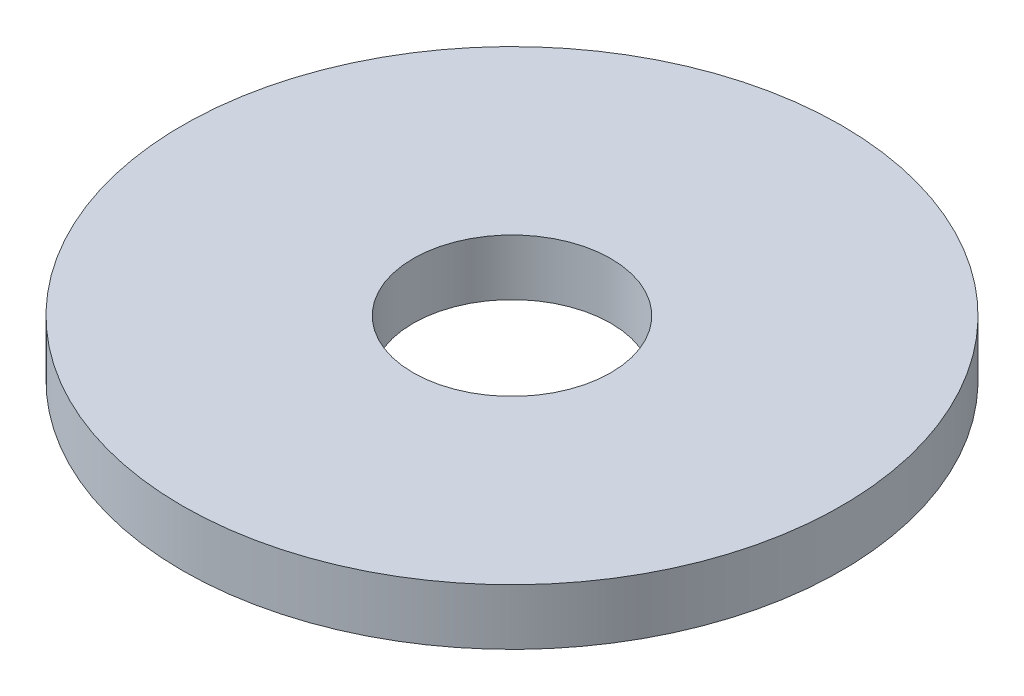
ISO-10303-21;
HEADER;
FILE_DESCRIPTION(('STEP AP214'),'2;1');
FILE_NAME('part.step','',(''),(''),'','','');
FILE_SCHEMA(('AUTOMOTIVE_DESIGN { 1 0 10303 214 1 1 1 1 }'));
ENDSEC;
DATA;
#1=APPLICATION_CONTEXT('core data for automotive mechanical design processes');
#2=APPLICATION_PROTOCOL_DEFINITION('international standard','automotive_design',2000,#1);
#3=PRODUCT_CONTEXT('',#1,'mechanical');
#4=PRODUCT('Part','Part','',(#3));
#5=PRODUCT_RELATED_PRODUCT_CATEGORY('part','',(#4));
#6=PRODUCT_DEFINITION_FORMATION('','',#4);
#7=PRODUCT_DEFINITION_CONTEXT('part definition',#1,'design');
#8=PRODUCT_DEFINITION('design','',#6,#7);
#9=PRODUCT_DEFINITION_SHAPE('','',#8);
#10=(LENGTH_UNIT() NAMED_UNIT(*) SI_UNIT(.MILLI.,.METRE.));
#11=(NAMED_UNIT(*) PLANE_ANGLE_UNIT() SI_UNIT($,.RADIAN.));
#12=(NAMED_UNIT(*) SI_UNIT($,.STERADIAN.) SOLID_ANGLE_UNIT());
#13=UNCERTAINTY_MEASURE_WITH_UNIT(LENGTH_MEASURE(1.E-05),#10,'distance_accuracy_value','');
#14=(GEOMETRIC_REPRESENTATION_CONTEXT(3) GLOBAL_UNCERTAINTY_ASSIGNED_CONTEXT((#13)) GLOBAL_UNIT_ASSIGNED_CONTEXT((#10,
#11,#12)) REPRESENTATION_CONTEXT('',''));
#15=CARTESIAN_POINT('',(0.,0.,0.));
#16=DIRECTION('',(0.,0.,1.));
#17=DIRECTION('',(1.,0.,0.));
#18=AXIS2_PLACEMENT_3D('',#15,#16,#17);
#19=CARTESIAN_POINT('',(0.,17.,0.));
#20=DIRECTION('',(0.,-1.,0.));
#21=DIRECTION('',(0.,0.,-1.));
#22=AXIS2_PLACEMENT_3D('',#19,#20,#21);
#23=CYLINDRICAL_SURFACE('',#22,100.);
#24=CARTESIAN_POINT('',(0.,17.,0.));
#25=DIRECTION('',(0.,1.,0.));
#26=DIRECTION('',(0.,0.,1.));
#27=AXIS2_PLACEMENT_3D('',#24,#25,#26);
#28=CIRCLE('',#27,100.);
#29=CARTESIAN_POINT('',(0.,17.,100.));
#30=VERTEX_POINT('',#29);
#31=EDGE_CURVE('E10',#30,#30,#28,.T.);
#32=ORIENTED_EDGE('',*,*,#31,.F.);
#33=EDGE_LOOP('',(#32));
#34=FACE_BOUND('',#33,.T.);
#35=CARTESIAN_POINT('',(0.,0.,0.));
#36=DIRECTION('',(0.,1.,0.));
#37=DIRECTION('',(0.,0.,1.));
#38=AXIS2_PLACEMENT_3D('',#35,#36,#37);
#39=CIRCLE('',#38,100.);
#40=CARTESIAN_POINT('',(0.,0.,100.));
#41=VERTEX_POINT('',#40);
#42=EDGE_CURVE('E37',#41,#41,#39,.T.);
#43=ORIENTED_EDGE('',*,*,#42,.T.);
#44=EDGE_LOOP('',(#43));
#45=FACE_BOUND('',#44,.T.);
#46=ADVANCED_FACE('F40',(#34,#45),#23,.T.);
#47=CARTESIAN_POINT('',(0.,17.,0.));
#48=DIRECTION('',(0.,1.,0.));
#49=DIRECTION('',(0.,0.,1.));
#50=AXIS2_PLACEMENT_3D('',#47,#48,#49);
#51=PLANE('',#50);
#52=CARTESIAN_POINT('',(0.,17.,0.));
#53=DIRECTION('',(0.,1.,0.));
#54=DIRECTION('',(0.,0.,1.));
#55=AXIS2_PLACEMENT_3D('',#52,#53,#54);
#56=CIRCLE('',#55,30.);
#57=CARTESIAN_POINT('',(0.,17.,30.));
#58=VERTEX_POINT('',#57);
#59=EDGE_CURVE('E50',#58,#58,#56,.T.);
#60=ORIENTED_EDGE('',*,*,#59,.F.);
#61=EDGE_LOOP('',(#60));
#62=FACE_BOUND('',#61,.T.);
#63=ORIENTED_EDGE('',*,*,#31,.T.);
#64=EDGE_LOOP('',(#63));
#65=FACE_BOUND('',#64,.T.);
#66=ADVANCED_FACE('F59',(#62,#65),#51,.T.);
#67=CARTESIAN_POINT('',(0.,0.,0.));
#68=DIRECTION('',(0.,1.,0.));
#69=DIRECTION('',(0.,0.,1.));
#70=AXIS2_PLACEMENT_3D('',#67,#68,#69);
#71=PLANE('',#70);
#72=CARTESIAN_POINT('',(0.,0.,0.));
#73=DIRECTION('',(0.,1.,0.));
#74=DIRECTION('',(0.,0.,1.));
#75=AXIS2_PLACEMENT_3D('',#72,#73,#74);
#76=CIRCLE('',#75,30.);
#77=CARTESIAN_POINT('',(0.,0.,30.));
#78=VERTEX_POINT('',#77);
#79=EDGE_CURVE('E47',#78,#78,#76,.T.);
#80=ORIENTED_EDGE('',*,*,#79,.T.);
#81=EDGE_LOOP('',(#80));
#82=FACE_BOUND('',#81,.T.);
#83=ORIENTED_EDGE('',*,*,#42,.F.);
#84=EDGE_LOOP('',(#83));
#85=FACE_BOUND('',#84,.T.);
#86=ADVANCED_FACE('F58',(#82,#85),#71,.F.);
#87=CARTESIAN_POINT('',(0.,17.,0.));
#88=DIRECTION('',(0.,-1.,0.));
#89=DIRECTION('',(0.,0.,-1.));
#90=AXIS2_PLACEMENT_3D('',#87,#88,#89);
#91=CYLINDRICAL_SURFACE('',#90,30.);
#92=ORIENTED_EDGE('',*,*,#59,.T.);
#93=EDGE_LOOP('',(#92));
#94=FACE_BOUND('',#93,.T.);
#95=ORIENTED_EDGE('',*,*,#79,.F.);
#96=EDGE_LOOP('',(#95));
#97=FACE_BOUND('',#96,.T.);
#98=ADVANCED_FACE('F54',(#94,#97),#91,.F.);
#99=CLOSED_SHELL('',(#46,#66,#86,#98));
#100=MANIFOLD_SOLID_BREP('B2',#99);
#101=ADVANCED_BREP_SHAPE_REPRESENTATION('',(#18,#100),#14);
#102=SHAPE_DEFINITION_REPRESENTATION(#9,#101);
ENDSEC;
END-ISO-10303-21;
